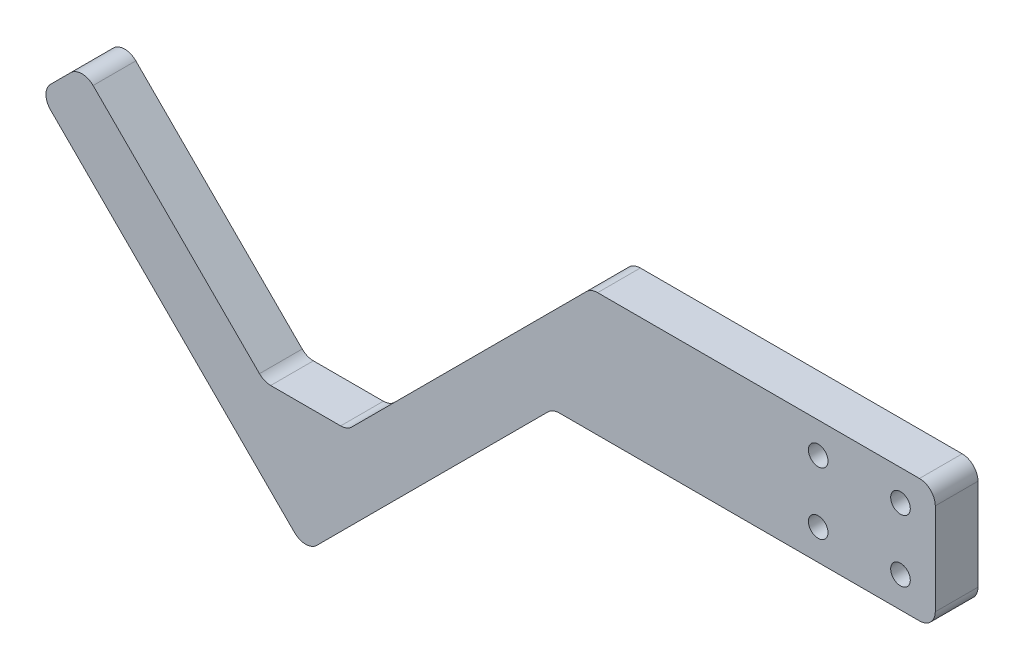
ISO-10303-21;
HEADER;
FILE_DESCRIPTION(('STEP AP214'),'2;1');
FILE_NAME('part.step','',(''),(''),'','','');
FILE_SCHEMA(('AUTOMOTIVE_DESIGN { 1 0 10303 214 1 1 1 1 }'));
ENDSEC;
DATA;
#1=APPLICATION_CONTEXT('core data for automotive mechanical design processes');
#2=APPLICATION_PROTOCOL_DEFINITION('international standard','automotive_design',2000,#1);
#3=PRODUCT_CONTEXT('',#1,'mechanical');
#4=PRODUCT('Part','Part','',(#3));
#5=PRODUCT_RELATED_PRODUCT_CATEGORY('part','',(#4));
#6=PRODUCT_DEFINITION_FORMATION('','',#4);
#7=PRODUCT_DEFINITION_CONTEXT('part definition',#1,'design');
#8=PRODUCT_DEFINITION('design','',#6,#7);
#9=PRODUCT_DEFINITION_SHAPE('','',#8);
#10=(LENGTH_UNIT() NAMED_UNIT(*) SI_UNIT(.MILLI.,.METRE.));
#11=(NAMED_UNIT(*) PLANE_ANGLE_UNIT() SI_UNIT($,.RADIAN.));
#12=(NAMED_UNIT(*) SI_UNIT($,.STERADIAN.) SOLID_ANGLE_UNIT());
#13=UNCERTAINTY_MEASURE_WITH_UNIT(LENGTH_MEASURE(1.E-05),#10,'distance_accuracy_value','');
#14=(GEOMETRIC_REPRESENTATION_CONTEXT(3) GLOBAL_UNCERTAINTY_ASSIGNED_CONTEXT((#13)) GLOBAL_UNIT_ASSIGNED_CONTEXT((#10,
#11,#12)) REPRESENTATION_CONTEXT('',''));
#15=CARTESIAN_POINT('',(0.,0.,0.));
#16=DIRECTION('',(0.,0.,1.));
#17=DIRECTION('',(1.,0.,0.));
#18=AXIS2_PLACEMENT_3D('',#15,#16,#17);
#19=CARTESIAN_POINT('',(0.,-57.5807358037434,13.5));
#20=DIRECTION('',(0.,1.,0.));
#21=DIRECTION('',(0.,0.,1.));
#22=AXIS2_PLACEMENT_3D('',#19,#20,#21);
#23=PLANE('',#22);
#24=DIRECTION('',(1.,0.,0.));
#25=VECTOR('',#24,1.);
#26=CARTESIAN_POINT('',(0.,-57.5807358037434,13.5));
#27=LINE('',#26,#25);
#28=CARTESIAN_POINT('',(-11.0588745030459,-57.5807358037434,13.5));
#29=VERTEX_POINT('',#28);
#30=CARTESIAN_POINT('',(11.0588745030475,-57.5807358037434,13.5));
#31=VERTEX_POINT('',#30);
#32=EDGE_CURVE('E318',#29,#31,#27,.T.);
#33=ORIENTED_EDGE('',*,*,#32,.T.);
#34=DIRECTION('',(0.,0.,-1.));
#35=VECTOR('',#34,1.);
#36=CARTESIAN_POINT('',(11.0588745030475,-57.5807358037434,0.));
#37=LINE('',#36,#35);
#38=CARTESIAN_POINT('',(11.0588745030475,-57.5807358037434,0.));
#39=VERTEX_POINT('',#38);
#40=EDGE_CURVE('E185',#31,#39,#37,.T.);
#41=ORIENTED_EDGE('',*,*,#40,.T.);
#42=DIRECTION('',(1.,0.,0.));
#43=VECTOR('',#42,1.);
#44=CARTESIAN_POINT('',(0.,-57.5807358037434,0.));
#45=LINE('',#44,#43);
#46=CARTESIAN_POINT('',(-11.0588745030459,-57.5807358037434,0.));
#47=VERTEX_POINT('',#46);
#48=EDGE_CURVE('E171',#47,#39,#45,.T.);
#49=ORIENTED_EDGE('',*,*,#48,.F.);
#50=DIRECTION('',(0.,0.,-1.));
#51=VECTOR('',#50,1.);
#52=CARTESIAN_POINT('',(-11.0588745030459,-57.5807358037434,13.5));
#53=LINE('',#52,#51);
#54=EDGE_CURVE('E182',#47,#29,#53,.F.);
#55=ORIENTED_EDGE('',*,*,#54,.T.);
#56=EDGE_LOOP('',(#33,#41,#49,#55));
#57=FACE_BOUND('',#56,.T.);
#58=ADVANCED_FACE('F41',(#57),#23,.T.);
#59=CARTESIAN_POINT('',(-35.3553390593274,-35.3553390593273,13.5));
#60=DIRECTION('',(0.707106781186549,0.707106781186546,0.));
#61=DIRECTION('',(-0.707106781186546,0.707106781186549,0.));
#62=AXIS2_PLACEMENT_3D('',#59,#60,#61);
#63=PLANE('',#62);
#64=DIRECTION('',(0.707106781186546,-0.707106781186549,0.));
#65=VECTOR('',#64,1.);
#66=CARTESIAN_POINT('',(-35.3553390593274,-35.3553390593273,0.));
#67=LINE('',#66,#65);
#68=CARTESIAN_POINT('',(-67.1751442127219,-3.53553390593273,0.));
#69=VERTEX_POINT('',#68);
#70=CARTESIAN_POINT('',(-14.5944084089787,-56.1162697096761,0.));
#71=VERTEX_POINT('',#70);
#72=EDGE_CURVE('E173',#69,#71,#67,.T.);
#73=ORIENTED_EDGE('',*,*,#72,.F.);
#74=DIRECTION('',(0.,0.,-1.));
#75=VECTOR('',#74,1.);
#76=CARTESIAN_POINT('',(-67.1751442127219,-3.53553390593274,13.5));
#77=LINE('',#76,#75);
#78=CARTESIAN_POINT('',(-67.1751442127219,-3.53553390593273,13.5));
#79=VERTEX_POINT('',#78);
#80=EDGE_CURVE('E258',#69,#79,#77,.F.);
#81=ORIENTED_EDGE('',*,*,#80,.T.);
#82=DIRECTION('',(0.707106781186546,-0.707106781186549,0.));
#83=VECTOR('',#82,1.);
#84=CARTESIAN_POINT('',(-35.3553390593274,-35.3553390593273,13.5));
#85=LINE('',#84,#83);
#86=CARTESIAN_POINT('',(-14.5944084089787,-56.1162697096761,13.5));
#87=VERTEX_POINT('',#86);
#88=EDGE_CURVE('E321',#79,#87,#85,.T.);
#89=ORIENTED_EDGE('',*,*,#88,.T.);
#90=DIRECTION('',(0.,0.,-1.));
#91=VECTOR('',#90,1.);
#92=CARTESIAN_POINT('',(-14.5944084089787,-56.1162697096761,0.));
#93=LINE('',#92,#91);
#94=EDGE_CURVE('E256',#87,#71,#93,.T.);
#95=ORIENTED_EDGE('',*,*,#94,.T.);
#96=EDGE_LOOP('',(#73,#81,#89,#95));
#97=FACE_BOUND('',#96,.T.);
#98=ADVANCED_FACE('F377',(#97),#63,.T.);
#99=CARTESIAN_POINT('',(-35.3553390593272,35.3553390593273,13.5));
#100=DIRECTION('',(0.707106781186546,-0.707106781186549,0.));
#101=DIRECTION('',(0.707106781186549,0.707106781186546,0.));
#102=AXIS2_PLACEMENT_3D('',#99,#100,#101);
#103=PLANE('',#102);
#104=DIRECTION('',(-0.707106781186549,-0.707106781186546,0.));
#105=VECTOR('',#104,1.);
#106=CARTESIAN_POINT('',(-35.3553390593272,35.3553390593273,0.));
#107=LINE('',#106,#105);
#108=CARTESIAN_POINT('',(-74.2462120245873,-3.53553390593272,0.));
#109=VERTEX_POINT('',#108);
#110=CARTESIAN_POINT('',(-80.6101730552663,-9.89949493661164,0.));
#111=VERTEX_POINT('',#110);
#112=EDGE_CURVE('E298',#109,#111,#107,.T.);
#113=ORIENTED_EDGE('',*,*,#112,.T.);
#114=DIRECTION('',(0.,0.,-1.));
#115=VECTOR('',#114,1.);
#116=CARTESIAN_POINT('',(-80.6101730552663,-9.89949493661164,13.5));
#117=LINE('',#116,#115);
#118=CARTESIAN_POINT('',(-80.6101730552663,-9.89949493661164,13.5));
#119=VERTEX_POINT('',#118);
#120=EDGE_CURVE('E254',#111,#119,#117,.F.);
#121=ORIENTED_EDGE('',*,*,#120,.T.);
#122=DIRECTION('',(-0.707106781186549,-0.707106781186546,0.));
#123=VECTOR('',#122,1.);
#124=CARTESIAN_POINT('',(-35.3553390593272,35.3553390593273,13.5));
#125=LINE('',#124,#123);
#126=CARTESIAN_POINT('',(-74.2462120245873,-3.53553390593272,13.5));
#127=VERTEX_POINT('',#126);
#128=EDGE_CURVE('E324',#127,#119,#125,.T.);
#129=ORIENTED_EDGE('',*,*,#128,.F.);
#130=DIRECTION('',(0.,0.,-1.));
#131=VECTOR('',#130,1.);
#132=CARTESIAN_POINT('',(-74.2462120245873,-3.53553390593272,0.));
#133=LINE('',#132,#131);
#134=EDGE_CURVE('E251',#127,#109,#133,.T.);
#135=ORIENTED_EDGE('',*,*,#134,.T.);
#136=EDGE_LOOP('',(#113,#121,#129,#135));
#137=FACE_BOUND('',#136,.T.);
#138=ADVANCED_FACE('F351',(#137),#103,.F.);
#139=CARTESIAN_POINT('',(-48.7903679018719,-48.7903679018717,13.5));
#140=DIRECTION('',(0.707106781186549,0.707106781186546,0.));
#141=DIRECTION('',(-0.707106781186546,0.707106781186549,0.));
#142=AXIS2_PLACEMENT_3D('',#139,#140,#141);
#143=PLANE('',#142);
#144=DIRECTION('',(0.707106781186546,-0.707106781186549,0.));
#145=VECTOR('',#144,1.);
#146=CARTESIAN_POINT('',(-48.7903679018719,-48.7903679018717,0.));
#147=LINE('',#146,#145);
#148=CARTESIAN_POINT('',(-80.6101730552663,-16.9705627484771,0.));
#149=VERTEX_POINT('',#148);
#150=CARTESIAN_POINT('',(-3.53553390593264,-94.0452018978111,0.));
#151=VERTEX_POINT('',#150);
#152=EDGE_CURVE('E293',#149,#151,#147,.T.);
#153=ORIENTED_EDGE('',*,*,#152,.T.);
#154=DIRECTION('',(0.,0.,-1.));
#155=VECTOR('',#154,1.);
#156=CARTESIAN_POINT('',(-3.53553390593264,-94.0452018978111,13.5));
#157=LINE('',#156,#155);
#158=CARTESIAN_POINT('',(-3.53553390593264,-94.0452018978111,13.5));
#159=VERTEX_POINT('',#158);
#160=EDGE_CURVE('E249',#151,#159,#157,.F.);
#161=ORIENTED_EDGE('',*,*,#160,.T.);
#162=DIRECTION('',(0.707106781186546,-0.707106781186549,0.));
#163=VECTOR('',#162,1.);
#164=CARTESIAN_POINT('',(-48.7903679018719,-48.7903679018717,13.5));
#165=LINE('',#164,#163);
#166=CARTESIAN_POINT('',(-80.6101730552663,-16.9705627484771,13.5));
#167=VERTEX_POINT('',#166);
#168=EDGE_CURVE('E329',#167,#159,#165,.T.);
#169=ORIENTED_EDGE('',*,*,#168,.F.);
#170=DIRECTION('',(0.,0.,-1.));
#171=VECTOR('',#170,1.);
#172=CARTESIAN_POINT('',(-80.6101730552663,-16.9705627484771,13.5));
#173=LINE('',#172,#171);
#174=EDGE_CURVE('E246',#167,#149,#173,.T.);
#175=ORIENTED_EDGE('',*,*,#174,.T.);
#176=EDGE_LOOP('',(#153,#161,#169,#175));
#177=FACE_BOUND('',#176,.T.);
#178=ADVANCED_FACE('F361',(#177),#143,.F.);
#179=CARTESIAN_POINT('',(48.7903679018719,-48.7903679018743,13.5));
#180=DIRECTION('',(-0.70710678118653,0.707106781186565,0.));
#181=DIRECTION('',(-0.707106781186565,-0.70710678118653,0.));
#182=AXIS2_PLACEMENT_3D('',#179,#180,#181);
#183=PLANE('',#182);
#184=DIRECTION('',(0.707106781186565,0.70710678118653,0.));
#185=VECTOR('',#184,1.);
#186=CARTESIAN_POINT('',(48.7903679018719,-48.7903679018743,0.));
#187=LINE('',#186,#185);
#188=CARTESIAN_POINT('',(3.53553390593275,-94.0452018978112,0.));
#189=VERTEX_POINT('',#188);
#190=CARTESIAN_POINT('',(76.6162697096804,-20.9644660940672,0.));
#191=VERTEX_POINT('',#190);
#192=EDGE_CURVE('E288',#189,#191,#187,.T.);
#193=ORIENTED_EDGE('',*,*,#192,.T.);
#194=DIRECTION('',(0.,0.,-1.));
#195=VECTOR('',#194,1.);
#196=CARTESIAN_POINT('',(76.6162697096804,-20.9644660940672,13.5));
#197=LINE('',#196,#195);
#198=CARTESIAN_POINT('',(76.6162697096804,-20.9644660940672,13.5));
#199=VERTEX_POINT('',#198);
#200=EDGE_CURVE('E244',#191,#199,#197,.F.);
#201=ORIENTED_EDGE('',*,*,#200,.T.);
#202=DIRECTION('',(0.707106781186565,0.70710678118653,0.));
#203=VECTOR('',#202,1.);
#204=CARTESIAN_POINT('',(48.7903679018719,-48.7903679018743,13.5));
#205=LINE('',#204,#203);
#206=CARTESIAN_POINT('',(3.53553390593275,-94.0452018978112,13.5));
#207=VERTEX_POINT('',#206);
#208=EDGE_CURVE('E274',#207,#199,#205,.T.);
#209=ORIENTED_EDGE('',*,*,#208,.F.);
#210=DIRECTION('',(0.,0.,-1.));
#211=VECTOR('',#210,1.);
#212=CARTESIAN_POINT('',(3.53553390593275,-94.0452018978112,13.5));
#213=LINE('',#212,#211);
#214=EDGE_CURVE('E241',#207,#189,#213,.T.);
#215=ORIENTED_EDGE('',*,*,#214,.T.);
#216=EDGE_LOOP('',(#193,#201,#209,#215));
#217=FACE_BOUND('',#216,.T.);
#218=ADVANCED_FACE('F291',(#217),#183,.F.);
#219=CARTESIAN_POINT('',(0.,-19.5,13.5));
#220=DIRECTION('',(0.,1.,0.));
#221=DIRECTION('',(0.,0.,1.));
#222=AXIS2_PLACEMENT_3D('',#219,#220,#221);
#223=PLANE('',#222);
#224=DIRECTION('',(1.,0.,0.));
#225=VECTOR('',#224,1.);
#226=CARTESIAN_POINT('',(0.,-19.5,0.));
#227=LINE('',#226,#225);
#228=CARTESIAN_POINT('',(80.151803615613,-19.5,0.));
#229=VERTEX_POINT('',#228);
#230=CARTESIAN_POINT('',(194.,-19.5,0.));
#231=VERTEX_POINT('',#230);
#232=EDGE_CURVE('E289',#229,#231,#227,.T.);
#233=ORIENTED_EDGE('',*,*,#232,.T.);
#234=DIRECTION('',(0.,0.,-1.));
#235=VECTOR('',#234,1.);
#236=CARTESIAN_POINT('',(194.,-19.5,13.5));
#237=LINE('',#236,#235);
#238=CARTESIAN_POINT('',(194.,-19.5,13.5));
#239=VERTEX_POINT('',#238);
#240=EDGE_CURVE('E239',#231,#239,#237,.F.);
#241=ORIENTED_EDGE('',*,*,#240,.T.);
#242=DIRECTION('',(1.,0.,0.));
#243=VECTOR('',#242,1.);
#244=CARTESIAN_POINT('',(0.,-19.5,13.5));
#245=LINE('',#244,#243);
#246=CARTESIAN_POINT('',(80.151803615613,-19.5,13.5));
#247=VERTEX_POINT('',#246);
#248=EDGE_CURVE('E272',#247,#239,#245,.T.);
#249=ORIENTED_EDGE('',*,*,#248,.F.);
#250=DIRECTION('',(0.,0.,-1.));
#251=VECTOR('',#250,1.);
#252=CARTESIAN_POINT('',(80.151803615613,-19.5,0.));
#253=LINE('',#252,#251);
#254=EDGE_CURVE('E236',#247,#229,#253,.T.);
#255=ORIENTED_EDGE('',*,*,#254,.T.);
#256=EDGE_LOOP('',(#233,#241,#249,#255));
#257=FACE_BOUND('',#256,.T.);
#258=ADVANCED_FACE('F280',(#257),#223,.F.);
#259=CARTESIAN_POINT('',(199.,0.,13.5));
#260=DIRECTION('',(-1.,0.,0.));
#261=DIRECTION('',(0.,0.,1.));
#262=AXIS2_PLACEMENT_3D('',#259,#260,#261);
#263=PLANE('',#262);
#264=DIRECTION('',(0.,1.,0.));
#265=VECTOR('',#264,1.);
#266=CARTESIAN_POINT('',(199.,0.,13.5));
#267=LINE('',#266,#265);
#268=CARTESIAN_POINT('',(199.,-14.5,13.5));
#269=VERTEX_POINT('',#268);
#270=CARTESIAN_POINT('',(199.,14.5,13.5));
#271=VERTEX_POINT('',#270);
#272=EDGE_CURVE('E283',#269,#271,#267,.T.);
#273=ORIENTED_EDGE('',*,*,#272,.F.);
#274=DIRECTION('',(0.,0.,-1.));
#275=VECTOR('',#274,1.);
#276=CARTESIAN_POINT('',(199.,-14.5,13.5));
#277=LINE('',#276,#275);
#278=CARTESIAN_POINT('',(199.,-14.5,0.));
#279=VERTEX_POINT('',#278);
#280=EDGE_CURVE('E233',#269,#279,#277,.T.);
#281=ORIENTED_EDGE('',*,*,#280,.T.);
#282=DIRECTION('',(0.,1.,0.));
#283=VECTOR('',#282,1.);
#284=CARTESIAN_POINT('',(199.,0.,0.));
#285=LINE('',#284,#283);
#286=CARTESIAN_POINT('',(199.,14.5,0.));
#287=VERTEX_POINT('',#286);
#288=EDGE_CURVE('E295',#279,#287,#285,.T.);
#289=ORIENTED_EDGE('',*,*,#288,.T.);
#290=DIRECTION('',(0.,0.,-1.));
#291=VECTOR('',#290,1.);
#292=CARTESIAN_POINT('',(199.,14.5,13.5));
#293=LINE('',#292,#291);
#294=EDGE_CURVE('E56',#287,#271,#293,.F.);
#295=ORIENTED_EDGE('',*,*,#294,.T.);
#296=EDGE_LOOP('',(#273,#281,#289,#295));
#297=FACE_BOUND('',#296,.T.);
#298=ADVANCED_FACE('F401',(#297),#263,.F.);
#299=CARTESIAN_POINT('',(0.,19.5,13.5));
#300=DIRECTION('',(0.,-1.,0.));
#301=DIRECTION('',(0.,0.,-1.));
#302=AXIS2_PLACEMENT_3D('',#299,#300,#301);
#303=PLANE('',#302);
#304=DIRECTION('',(-1.,0.,0.));
#305=VECTOR('',#304,1.);
#306=CARTESIAN_POINT('',(0.,19.5,0.));
#307=LINE('',#306,#305);
#308=CARTESIAN_POINT('',(194.,19.5,0.));
#309=VERTEX_POINT('',#308);
#310=CARTESIAN_POINT('',(92.2817459305294,19.5,0.));
#311=VERTEX_POINT('',#310);
#312=EDGE_CURVE('E303',#309,#311,#307,.T.);
#313=ORIENTED_EDGE('',*,*,#312,.T.);
#314=DIRECTION('',(0.,0.,-1.));
#315=VECTOR('',#314,1.);
#316=CARTESIAN_POINT('',(92.2817459305294,19.5,13.5));
#317=LINE('',#316,#315);
#318=CARTESIAN_POINT('',(92.2817459305294,19.5,13.5));
#319=VERTEX_POINT('',#318);
#320=EDGE_CURVE('E219',#311,#319,#317,.F.);
#321=ORIENTED_EDGE('',*,*,#320,.T.);
#322=DIRECTION('',(-1.,0.,0.));
#323=VECTOR('',#322,1.);
#324=CARTESIAN_POINT('',(0.,19.5,13.5));
#325=LINE('',#324,#323);
#326=CARTESIAN_POINT('',(194.,19.5,13.5));
#327=VERTEX_POINT('',#326);
#328=EDGE_CURVE('E334',#327,#319,#325,.T.);
#329=ORIENTED_EDGE('',*,*,#328,.F.);
#330=DIRECTION('',(0.,0.,-1.));
#331=VECTOR('',#330,1.);
#332=CARTESIAN_POINT('',(194.,19.5,13.5));
#333=LINE('',#332,#331);
#334=EDGE_CURVE('E216',#327,#309,#333,.T.);
#335=ORIENTED_EDGE('',*,*,#334,.T.);
#336=EDGE_LOOP('',(#313,#321,#329,#335));
#337=FACE_BOUND('',#336,.T.);
#338=ADVANCED_FACE('F408',(#337),#303,.F.);
#339=CARTESIAN_POINT('',(162.,9.8,13.5));
#340=DIRECTION('',(0.,0.,-1.));
#341=DIRECTION('',(-1.,0.,0.));
#342=AXIS2_PLACEMENT_3D('',#339,#340,#341);
#343=CYLINDRICAL_SURFACE('',#342,3.09999999999999);
#344=CARTESIAN_POINT('',(162.,9.8,13.5));
#345=DIRECTION('',(0.,0.,1.));
#346=DIRECTION('',(1.,0.,0.));
#347=AXIS2_PLACEMENT_3D('',#344,#345,#346);
#348=CIRCLE('',#347,3.09999999999999);
#349=CARTESIAN_POINT('',(165.1,9.8,13.5));
#350=VERTEX_POINT('',#349);
#351=EDGE_CURVE('E194',#350,#350,#348,.T.);
#352=ORIENTED_EDGE('',*,*,#351,.T.);
#353=EDGE_LOOP('',(#352));
#354=FACE_BOUND('',#353,.T.);
#355=CARTESIAN_POINT('',(162.,9.8,0.));
#356=DIRECTION('',(0.,0.,1.));
#357=DIRECTION('',(1.,0.,0.));
#358=AXIS2_PLACEMENT_3D('',#355,#356,#357);
#359=CIRCLE('',#358,3.09999999999999);
#360=CARTESIAN_POINT('',(165.1,9.8,0.));
#361=VERTEX_POINT('',#360);
#362=EDGE_CURVE('E313',#361,#361,#359,.T.);
#363=ORIENTED_EDGE('',*,*,#362,.F.);
#364=EDGE_LOOP('',(#363));
#365=FACE_BOUND('',#364,.T.);
#366=ADVANCED_FACE('F508',(#354,#365),#343,.F.);
#367=CARTESIAN_POINT('',(162.,-9.8,13.5));
#368=DIRECTION('',(0.,0.,-1.));
#369=DIRECTION('',(-1.,0.,0.));
#370=AXIS2_PLACEMENT_3D('',#367,#368,#369);
#371=CYLINDRICAL_SURFACE('',#370,3.09999999999999);
#372=CARTESIAN_POINT('',(162.,-9.8,13.5));
#373=DIRECTION('',(0.,0.,1.));
#374=DIRECTION('',(1.,0.,0.));
#375=AXIS2_PLACEMENT_3D('',#372,#373,#374);
#376=CIRCLE('',#375,3.09999999999999);
#377=CARTESIAN_POINT('',(165.1,-9.8,13.5));
#378=VERTEX_POINT('',#377);
#379=EDGE_CURVE('E342',#378,#378,#376,.T.);
#380=ORIENTED_EDGE('',*,*,#379,.T.);
#381=EDGE_LOOP('',(#380));
#382=FACE_BOUND('',#381,.T.);
#383=CARTESIAN_POINT('',(162.,-9.8,0.));
#384=DIRECTION('',(0.,0.,1.));
#385=DIRECTION('',(1.,0.,0.));
#386=AXIS2_PLACEMENT_3D('',#383,#384,#385);
#387=CIRCLE('',#386,3.09999999999999);
#388=CARTESIAN_POINT('',(165.1,-9.8,0.));
#389=VERTEX_POINT('',#388);
#390=EDGE_CURVE('E311',#389,#389,#387,.T.);
#391=ORIENTED_EDGE('',*,*,#390,.F.);
#392=EDGE_LOOP('',(#391));
#393=FACE_BOUND('',#392,.T.);
#394=ADVANCED_FACE('F567',(#382,#393),#371,.F.);
#395=CARTESIAN_POINT('',(188.,-9.8,13.5));
#396=DIRECTION('',(0.,0.,-1.));
#397=DIRECTION('',(-1.,0.,0.));
#398=AXIS2_PLACEMENT_3D('',#395,#396,#397);
#399=CYLINDRICAL_SURFACE('',#398,3.09999999999999);
#400=CARTESIAN_POINT('',(188.,-9.8,13.5));
#401=DIRECTION('',(0.,0.,1.));
#402=DIRECTION('',(1.,0.,0.));
#403=AXIS2_PLACEMENT_3D('',#400,#401,#402);
#404=CIRCLE('',#403,3.09999999999999);
#405=CARTESIAN_POINT('',(191.1,-9.8,13.5));
#406=VERTEX_POINT('',#405);
#407=EDGE_CURVE('E339',#406,#406,#404,.T.);
#408=ORIENTED_EDGE('',*,*,#407,.T.);
#409=EDGE_LOOP('',(#408));
#410=FACE_BOUND('',#409,.T.);
#411=CARTESIAN_POINT('',(188.,-9.8,0.));
#412=DIRECTION('',(0.,0.,1.));
#413=DIRECTION('',(1.,0.,0.));
#414=AXIS2_PLACEMENT_3D('',#411,#412,#413);
#415=CIRCLE('',#414,3.09999999999999);
#416=CARTESIAN_POINT('',(191.1,-9.8,0.));
#417=VERTEX_POINT('',#416);
#418=EDGE_CURVE('E308',#417,#417,#415,.T.);
#419=ORIENTED_EDGE('',*,*,#418,.F.);
#420=EDGE_LOOP('',(#419));
#421=FACE_BOUND('',#420,.T.);
#422=ADVANCED_FACE('F498',(#410,#421),#399,.F.);
#423=CARTESIAN_POINT('',(35.3553390593274,-35.355339059331,13.5));
#424=DIRECTION('',(-0.707106781186511,0.707106781186583,0.));
#425=DIRECTION('',(-0.707106781186584,-0.707106781186512,0.));
#426=AXIS2_PLACEMENT_3D('',#423,#424,#425);
#427=PLANE('',#426);
#428=DIRECTION('',(0.707106781186584,0.707106781186512,0.));
#429=VECTOR('',#428,1.);
#430=CARTESIAN_POINT('',(35.3553390593274,-35.355339059331,0.));
#431=LINE('',#430,#429);
#432=CARTESIAN_POINT('',(14.59440840898,-56.1162697096763,0.));
#433=VERTEX_POINT('',#432);
#434=CARTESIAN_POINT('',(88.7462120245968,18.0355339059329,0.));
#435=VERTEX_POINT('',#434);
#436=EDGE_CURVE('E306',#433,#435,#431,.T.);
#437=ORIENTED_EDGE('',*,*,#436,.F.);
#438=DIRECTION('',(0.,0.,-1.));
#439=VECTOR('',#438,1.);
#440=CARTESIAN_POINT('',(14.59440840898,-56.1162697096763,13.5));
#441=LINE('',#440,#439);
#442=CARTESIAN_POINT('',(14.59440840898,-56.1162697096763,13.5));
#443=VERTEX_POINT('',#442);
#444=EDGE_CURVE('E202',#433,#443,#441,.F.);
#445=ORIENTED_EDGE('',*,*,#444,.T.);
#446=DIRECTION('',(0.707106781186584,0.707106781186512,0.));
#447=VECTOR('',#446,1.);
#448=CARTESIAN_POINT('',(35.3553390593274,-35.355339059331,13.5));
#449=LINE('',#448,#447);
#450=CARTESIAN_POINT('',(88.7462120245968,18.0355339059329,13.5));
#451=VERTEX_POINT('',#450);
#452=EDGE_CURVE('E336',#443,#451,#449,.T.);
#453=ORIENTED_EDGE('',*,*,#452,.T.);
#454=DIRECTION('',(0.,0.,-1.));
#455=VECTOR('',#454,1.);
#456=CARTESIAN_POINT('',(88.7462120245968,18.0355339059329,0.));
#457=LINE('',#456,#455);
#458=EDGE_CURVE('E191',#451,#435,#457,.T.);
#459=ORIENTED_EDGE('',*,*,#458,.T.);
#460=EDGE_LOOP('',(#437,#445,#453,#459));
#461=FACE_BOUND('',#460,.T.);
#462=ADVANCED_FACE('F415',(#461),#427,.T.);
#463=CARTESIAN_POINT('',(188.,9.8,13.5));
#464=DIRECTION('',(0.,0.,-1.));
#465=DIRECTION('',(-1.,0.,0.));
#466=AXIS2_PLACEMENT_3D('',#463,#464,#465);
#467=CYLINDRICAL_SURFACE('',#466,3.09999999999999);
#468=CARTESIAN_POINT('',(188.,9.8,13.5));
#469=DIRECTION('',(0.,0.,1.));
#470=DIRECTION('',(1.,0.,0.));
#471=AXIS2_PLACEMENT_3D('',#468,#469,#470);
#472=CIRCLE('',#471,3.09999999999999);
#473=CARTESIAN_POINT('',(191.1,9.8,13.5));
#474=VERTEX_POINT('',#473);
#475=EDGE_CURVE('E189',#474,#474,#472,.T.);
#476=ORIENTED_EDGE('',*,*,#475,.T.);
#477=EDGE_LOOP('',(#476));
#478=FACE_BOUND('',#477,.T.);
#479=CARTESIAN_POINT('',(188.,9.8,0.));
#480=DIRECTION('',(0.,0.,1.));
#481=DIRECTION('',(1.,0.,0.));
#482=AXIS2_PLACEMENT_3D('',#479,#480,#481);
#483=CIRCLE('',#482,3.09999999999999);
#484=CARTESIAN_POINT('',(191.1,9.8,0.));
#485=VERTEX_POINT('',#484);
#486=EDGE_CURVE('E197',#485,#485,#483,.T.);
#487=ORIENTED_EDGE('',*,*,#486,.F.);
#488=EDGE_LOOP('',(#487));
#489=FACE_BOUND('',#488,.T.);
#490=ADVANCED_FACE('F490',(#478,#489),#467,.F.);
#491=CARTESIAN_POINT('',(0.,0.,13.5));
#492=DIRECTION('',(0.,0.,1.));
#493=DIRECTION('',(1.,0.,0.));
#494=AXIS2_PLACEMENT_3D('',#491,#492,#493);
#495=PLANE('',#494);
#496=ORIENTED_EDGE('',*,*,#328,.T.);
#497=CARTESIAN_POINT('',(92.2817459305294,14.5,13.5));
#498=DIRECTION('',(0.,0.,1.));
#499=DIRECTION('',(1.,0.,0.));
#500=AXIS2_PLACEMENT_3D('',#497,#498,#499);
#501=CIRCLE('',#500,5.);
#502=EDGE_CURVE('E230',#319,#451,#501,.T.);
#503=ORIENTED_EDGE('',*,*,#502,.T.);
#504=ORIENTED_EDGE('',*,*,#452,.F.);
#505=CARTESIAN_POINT('',(11.0588745030475,-52.5807358037434,13.5));
#506=DIRECTION('',(0.,0.,1.));
#507=DIRECTION('',(1.,0.,0.));
#508=AXIS2_PLACEMENT_3D('',#505,#506,#507);
#509=CIRCLE('',#508,5.);
#510=EDGE_CURVE('E262',#443,#31,#509,.F.);
#511=ORIENTED_EDGE('',*,*,#510,.T.);
#512=ORIENTED_EDGE('',*,*,#32,.F.);
#513=CARTESIAN_POINT('',(-11.0588745030459,-52.5807358037434,13.5));
#514=DIRECTION('',(0.,0.,1.));
#515=DIRECTION('',(1.,0.,0.));
#516=AXIS2_PLACEMENT_3D('',#513,#514,#515);
#517=CIRCLE('',#516,5.);
#518=EDGE_CURVE('E11',#29,#87,#517,.F.);
#519=ORIENTED_EDGE('',*,*,#518,.T.);
#520=ORIENTED_EDGE('',*,*,#88,.F.);
#521=CARTESIAN_POINT('',(-70.7106781186546,-7.07106781186546,13.5));
#522=DIRECTION('',(0.,0.,1.));
#523=DIRECTION('',(1.,0.,0.));
#524=AXIS2_PLACEMENT_3D('',#521,#522,#523);
#525=CIRCLE('',#524,5.);
#526=EDGE_CURVE('E223',#79,#127,#525,.T.);
#527=ORIENTED_EDGE('',*,*,#526,.T.);
#528=ORIENTED_EDGE('',*,*,#128,.T.);
#529=CARTESIAN_POINT('',(-77.0746391493335,-13.4350288425444,13.5));
#530=DIRECTION('',(0.,0.,1.));
#531=DIRECTION('',(1.,0.,0.));
#532=AXIS2_PLACEMENT_3D('',#529,#530,#531);
#533=CIRCLE('',#532,5.);
#534=EDGE_CURVE('E225',#119,#167,#533,.T.);
#535=ORIENTED_EDGE('',*,*,#534,.T.);
#536=ORIENTED_EDGE('',*,*,#168,.T.);
#537=CARTESIAN_POINT('',(0.,-90.5096679918783,13.5));
#538=DIRECTION('',(0.,0.,1.));
#539=DIRECTION('',(1.,0.,0.));
#540=AXIS2_PLACEMENT_3D('',#537,#538,#539);
#541=CIRCLE('',#540,5.);
#542=EDGE_CURVE('E227',#159,#207,#541,.T.);
#543=ORIENTED_EDGE('',*,*,#542,.T.);
#544=ORIENTED_EDGE('',*,*,#208,.T.);
#545=CARTESIAN_POINT('',(80.151803615613,-24.5,13.5));
#546=DIRECTION('',(0.,0.,1.));
#547=DIRECTION('',(1.,0.,0.));
#548=AXIS2_PLACEMENT_3D('',#545,#546,#547);
#549=CIRCLE('',#548,5.);
#550=EDGE_CURVE('E178',#199,#247,#549,.F.);
#551=ORIENTED_EDGE('',*,*,#550,.T.);
#552=ORIENTED_EDGE('',*,*,#248,.T.);
#553=CARTESIAN_POINT('',(194.,-14.5,13.5));
#554=DIRECTION('',(0.,0.,1.));
#555=DIRECTION('',(1.,0.,0.));
#556=AXIS2_PLACEMENT_3D('',#553,#554,#555);
#557=CIRCLE('',#556,5.);
#558=EDGE_CURVE('E63',#239,#269,#557,.T.);
#559=ORIENTED_EDGE('',*,*,#558,.T.);
#560=ORIENTED_EDGE('',*,*,#272,.T.);
#561=CARTESIAN_POINT('',(194.,14.5,13.5));
#562=DIRECTION('',(0.,0.,1.));
#563=DIRECTION('',(1.,0.,0.));
#564=AXIS2_PLACEMENT_3D('',#561,#562,#563);
#565=CIRCLE('',#564,5.);
#566=EDGE_CURVE('E221',#271,#327,#565,.T.);
#567=ORIENTED_EDGE('',*,*,#566,.T.);
#568=EDGE_LOOP('',(#496,#503,#504,#511,#512,#519,#520,#527,#528,#535,#536,#543,#544,#551,#552,
#559,#560,#567));
#569=FACE_BOUND('',#568,.T.);
#570=ORIENTED_EDGE('',*,*,#407,.F.);
#571=EDGE_LOOP('',(#570));
#572=FACE_BOUND('',#571,.T.);
#573=ORIENTED_EDGE('',*,*,#379,.F.);
#574=EDGE_LOOP('',(#573));
#575=FACE_BOUND('',#574,.T.);
#576=ORIENTED_EDGE('',*,*,#351,.F.);
#577=EDGE_LOOP('',(#576));
#578=FACE_BOUND('',#577,.T.);
#579=ORIENTED_EDGE('',*,*,#475,.F.);
#580=EDGE_LOOP('',(#579));
#581=FACE_BOUND('',#580,.T.);
#582=ADVANCED_FACE('F270',(#569,#572,#575,#578,#581),#495,.T.);
#583=CARTESIAN_POINT('',(0.,0.,0.));
#584=DIRECTION('',(0.,0.,1.));
#585=DIRECTION('',(1.,0.,0.));
#586=AXIS2_PLACEMENT_3D('',#583,#584,#585);
#587=PLANE('',#586);
#588=ORIENTED_EDGE('',*,*,#436,.T.);
#589=CARTESIAN_POINT('',(92.2817459305294,14.5,0.));
#590=DIRECTION('',(0.,0.,1.));
#591=DIRECTION('',(1.,0.,0.));
#592=AXIS2_PLACEMENT_3D('',#589,#590,#591);
#593=CIRCLE('',#592,5.);
#594=EDGE_CURVE('E214',#435,#311,#593,.F.);
#595=ORIENTED_EDGE('',*,*,#594,.T.);
#596=ORIENTED_EDGE('',*,*,#312,.F.);
#597=CARTESIAN_POINT('',(194.,14.5,0.));
#598=DIRECTION('',(0.,0.,1.));
#599=DIRECTION('',(1.,0.,0.));
#600=AXIS2_PLACEMENT_3D('',#597,#598,#599);
#601=CIRCLE('',#600,5.);
#602=EDGE_CURVE('E204',#309,#287,#601,.F.);
#603=ORIENTED_EDGE('',*,*,#602,.T.);
#604=ORIENTED_EDGE('',*,*,#288,.F.);
#605=CARTESIAN_POINT('',(194.,-14.5,0.));
#606=DIRECTION('',(0.,0.,1.));
#607=DIRECTION('',(1.,0.,0.));
#608=AXIS2_PLACEMENT_3D('',#605,#606,#607);
#609=CIRCLE('',#608,5.);
#610=EDGE_CURVE('E212',#279,#231,#609,.F.);
#611=ORIENTED_EDGE('',*,*,#610,.T.);
#612=ORIENTED_EDGE('',*,*,#232,.F.);
#613=CARTESIAN_POINT('',(80.151803615613,-24.5,0.));
#614=DIRECTION('',(0.,0.,1.));
#615=DIRECTION('',(1.,0.,0.));
#616=AXIS2_PLACEMENT_3D('',#613,#614,#615);
#617=CIRCLE('',#616,5.);
#618=EDGE_CURVE('E264',#229,#191,#617,.T.);
#619=ORIENTED_EDGE('',*,*,#618,.T.);
#620=ORIENTED_EDGE('',*,*,#192,.F.);
#621=CARTESIAN_POINT('',(0.,-90.5096679918783,0.));
#622=DIRECTION('',(0.,0.,1.));
#623=DIRECTION('',(1.,0.,0.));
#624=AXIS2_PLACEMENT_3D('',#621,#622,#623);
#625=CIRCLE('',#624,5.);
#626=EDGE_CURVE('E210',#189,#151,#625,.F.);
#627=ORIENTED_EDGE('',*,*,#626,.T.);
#628=ORIENTED_EDGE('',*,*,#152,.F.);
#629=CARTESIAN_POINT('',(-77.0746391493335,-13.4350288425444,0.));
#630=DIRECTION('',(0.,0.,1.));
#631=DIRECTION('',(1.,0.,0.));
#632=AXIS2_PLACEMENT_3D('',#629,#630,#631);
#633=CIRCLE('',#632,5.);
#634=EDGE_CURVE('E208',#149,#111,#633,.F.);
#635=ORIENTED_EDGE('',*,*,#634,.T.);
#636=ORIENTED_EDGE('',*,*,#112,.F.);
#637=CARTESIAN_POINT('',(-70.7106781186546,-7.07106781186546,0.));
#638=DIRECTION('',(0.,0.,1.));
#639=DIRECTION('',(1.,0.,0.));
#640=AXIS2_PLACEMENT_3D('',#637,#638,#639);
#641=CIRCLE('',#640,5.);
#642=EDGE_CURVE('E206',#109,#69,#641,.F.);
#643=ORIENTED_EDGE('',*,*,#642,.T.);
#644=ORIENTED_EDGE('',*,*,#72,.T.);
#645=CARTESIAN_POINT('',(-11.0588745030459,-52.5807358037434,0.));
#646=DIRECTION('',(0.,0.,1.));
#647=DIRECTION('',(1.,0.,0.));
#648=AXIS2_PLACEMENT_3D('',#645,#646,#647);
#649=CIRCLE('',#648,5.);
#650=EDGE_CURVE('E49',#71,#47,#649,.T.);
#651=ORIENTED_EDGE('',*,*,#650,.T.);
#652=ORIENTED_EDGE('',*,*,#48,.T.);
#653=CARTESIAN_POINT('',(11.0588745030475,-52.5807358037434,0.));
#654=DIRECTION('',(0.,0.,1.));
#655=DIRECTION('',(1.,0.,0.));
#656=AXIS2_PLACEMENT_3D('',#653,#654,#655);
#657=CIRCLE('',#656,5.);
#658=EDGE_CURVE('E260',#39,#433,#657,.T.);
#659=ORIENTED_EDGE('',*,*,#658,.T.);
#660=EDGE_LOOP('',(#588,#595,#596,#603,#604,#611,#612,#619,#620,#627,#628,#635,#636,#643,#644,
#651,#652,#659));
#661=FACE_BOUND('',#660,.T.);
#662=ORIENTED_EDGE('',*,*,#418,.T.);
#663=EDGE_LOOP('',(#662));
#664=FACE_BOUND('',#663,.T.);
#665=ORIENTED_EDGE('',*,*,#390,.T.);
#666=EDGE_LOOP('',(#665));
#667=FACE_BOUND('',#666,.T.);
#668=ORIENTED_EDGE('',*,*,#362,.T.);
#669=EDGE_LOOP('',(#668));
#670=FACE_BOUND('',#669,.T.);
#671=ORIENTED_EDGE('',*,*,#486,.T.);
#672=EDGE_LOOP('',(#671));
#673=FACE_BOUND('',#672,.T.);
#674=ADVANCED_FACE('F169',(#661,#664,#667,#670,#673),#587,.F.);
#675=CARTESIAN_POINT('',(11.0588745030475,-52.5807358037434,13.5));
#676=DIRECTION('',(0.,0.,1.));
#677=DIRECTION('',(1.,0.,0.));
#678=AXIS2_PLACEMENT_3D('',#675,#676,#677);
#679=CYLINDRICAL_SURFACE('',#678,5.);
#680=ORIENTED_EDGE('',*,*,#510,.F.);
#681=ORIENTED_EDGE('',*,*,#444,.F.);
#682=ORIENTED_EDGE('',*,*,#658,.F.);
#683=ORIENTED_EDGE('',*,*,#40,.F.);
#684=EDGE_LOOP('',(#680,#681,#682,#683));
#685=FACE_BOUND('',#684,.T.);
#686=ADVANCED_FACE('F387',(#685),#679,.F.);
#687=CARTESIAN_POINT('',(92.2817459305294,14.5,13.5));
#688=DIRECTION('',(0.,0.,1.));
#689=DIRECTION('',(1.,0.,0.));
#690=AXIS2_PLACEMENT_3D('',#687,#688,#689);
#691=CYLINDRICAL_SURFACE('',#690,5.);
#692=ORIENTED_EDGE('',*,*,#502,.F.);
#693=ORIENTED_EDGE('',*,*,#320,.F.);
#694=ORIENTED_EDGE('',*,*,#594,.F.);
#695=ORIENTED_EDGE('',*,*,#458,.F.);
#696=EDGE_LOOP('',(#692,#693,#694,#695));
#697=FACE_BOUND('',#696,.T.);
#698=ADVANCED_FACE('F390',(#697),#691,.T.);
#699=CARTESIAN_POINT('',(194.,-14.5,13.5));
#700=DIRECTION('',(0.,0.,-1.));
#701=DIRECTION('',(-1.,0.,0.));
#702=AXIS2_PLACEMENT_3D('',#699,#700,#701);
#703=CYLINDRICAL_SURFACE('',#702,5.);
#704=ORIENTED_EDGE('',*,*,#558,.F.);
#705=ORIENTED_EDGE('',*,*,#240,.F.);
#706=ORIENTED_EDGE('',*,*,#610,.F.);
#707=ORIENTED_EDGE('',*,*,#280,.F.);
#708=EDGE_LOOP('',(#704,#705,#706,#707));
#709=FACE_BOUND('',#708,.T.);
#710=ADVANCED_FACE('F374',(#709),#703,.T.);
#711=CARTESIAN_POINT('',(80.151803615613,-24.5,13.5));
#712=DIRECTION('',(0.,0.,1.));
#713=DIRECTION('',(1.,0.,0.));
#714=AXIS2_PLACEMENT_3D('',#711,#712,#713);
#715=CYLINDRICAL_SURFACE('',#714,5.);
#716=ORIENTED_EDGE('',*,*,#550,.F.);
#717=ORIENTED_EDGE('',*,*,#200,.F.);
#718=ORIENTED_EDGE('',*,*,#618,.F.);
#719=ORIENTED_EDGE('',*,*,#254,.F.);
#720=EDGE_LOOP('',(#716,#717,#718,#719));
#721=FACE_BOUND('',#720,.T.);
#722=ADVANCED_FACE('F285',(#721),#715,.F.);
#723=CARTESIAN_POINT('',(0.,-90.5096679918783,13.5));
#724=DIRECTION('',(0.,0.,-1.));
#725=DIRECTION('',(-1.,0.,0.));
#726=AXIS2_PLACEMENT_3D('',#723,#724,#725);
#727=CYLINDRICAL_SURFACE('',#726,5.);
#728=ORIENTED_EDGE('',*,*,#542,.F.);
#729=ORIENTED_EDGE('',*,*,#160,.F.);
#730=ORIENTED_EDGE('',*,*,#626,.F.);
#731=ORIENTED_EDGE('',*,*,#214,.F.);
#732=EDGE_LOOP('',(#728,#729,#730,#731));
#733=FACE_BOUND('',#732,.T.);
#734=ADVANCED_FACE('F365',(#733),#727,.T.);
#735=CARTESIAN_POINT('',(-77.0746391493335,-13.4350288425444,13.5));
#736=DIRECTION('',(0.,0.,-1.));
#737=DIRECTION('',(-1.,0.,0.));
#738=AXIS2_PLACEMENT_3D('',#735,#736,#737);
#739=CYLINDRICAL_SURFACE('',#738,5.);
#740=ORIENTED_EDGE('',*,*,#534,.F.);
#741=ORIENTED_EDGE('',*,*,#120,.F.);
#742=ORIENTED_EDGE('',*,*,#634,.F.);
#743=ORIENTED_EDGE('',*,*,#174,.F.);
#744=EDGE_LOOP('',(#740,#741,#742,#743));
#745=FACE_BOUND('',#744,.T.);
#746=ADVANCED_FACE('F356',(#745),#739,.T.);
#747=CARTESIAN_POINT('',(-70.7106781186546,-7.07106781186546,13.5));
#748=DIRECTION('',(0.,0.,1.));
#749=DIRECTION('',(1.,0.,0.));
#750=AXIS2_PLACEMENT_3D('',#747,#748,#749);
#751=CYLINDRICAL_SURFACE('',#750,5.);
#752=ORIENTED_EDGE('',*,*,#526,.F.);
#753=ORIENTED_EDGE('',*,*,#80,.F.);
#754=ORIENTED_EDGE('',*,*,#642,.F.);
#755=ORIENTED_EDGE('',*,*,#134,.F.);
#756=EDGE_LOOP('',(#752,#753,#754,#755));
#757=FACE_BOUND('',#756,.T.);
#758=ADVANCED_FACE('F372',(#757),#751,.T.);
#759=CARTESIAN_POINT('',(-11.0588745030459,-52.5807358037434,13.5));
#760=DIRECTION('',(0.,0.,1.));
#761=DIRECTION('',(1.,0.,0.));
#762=AXIS2_PLACEMENT_3D('',#759,#760,#761);
#763=CYLINDRICAL_SURFACE('',#762,5.);
#764=ORIENTED_EDGE('',*,*,#518,.F.);
#765=ORIENTED_EDGE('',*,*,#54,.F.);
#766=ORIENTED_EDGE('',*,*,#650,.F.);
#767=ORIENTED_EDGE('',*,*,#94,.F.);
#768=EDGE_LOOP('',(#764,#765,#766,#767));
#769=FACE_BOUND('',#768,.T.);
#770=ADVANCED_FACE('F188',(#769),#763,.F.);
#771=CARTESIAN_POINT('',(194.,14.5,13.5));
#772=DIRECTION('',(0.,0.,-1.));
#773=DIRECTION('',(-1.,0.,0.));
#774=AXIS2_PLACEMENT_3D('',#771,#772,#773);
#775=CYLINDRICAL_SURFACE('',#774,5.);
#776=ORIENTED_EDGE('',*,*,#566,.F.);
#777=ORIENTED_EDGE('',*,*,#294,.F.);
#778=ORIENTED_EDGE('',*,*,#602,.F.);
#779=ORIENTED_EDGE('',*,*,#334,.F.);
#780=EDGE_LOOP('',(#776,#777,#778,#779));
#781=FACE_BOUND('',#780,.T.);
#782=ADVANCED_FACE('F43',(#781),#775,.T.);
#783=CLOSED_SHELL('',(#58,#98,#138,#178,#218,#258,#298,#338,#366,#394,#422,#462,#490,#582,#674,
#686,#698,#710,#722,#734,#746,#758,#770,#782));
#784=MANIFOLD_SOLID_BREP('B2',#783);
#785=ADVANCED_BREP_SHAPE_REPRESENTATION('',(#18,#784),#14);
#786=SHAPE_DEFINITION_REPRESENTATION(#9,#785);
ENDSEC;
END-ISO-10303-21;
